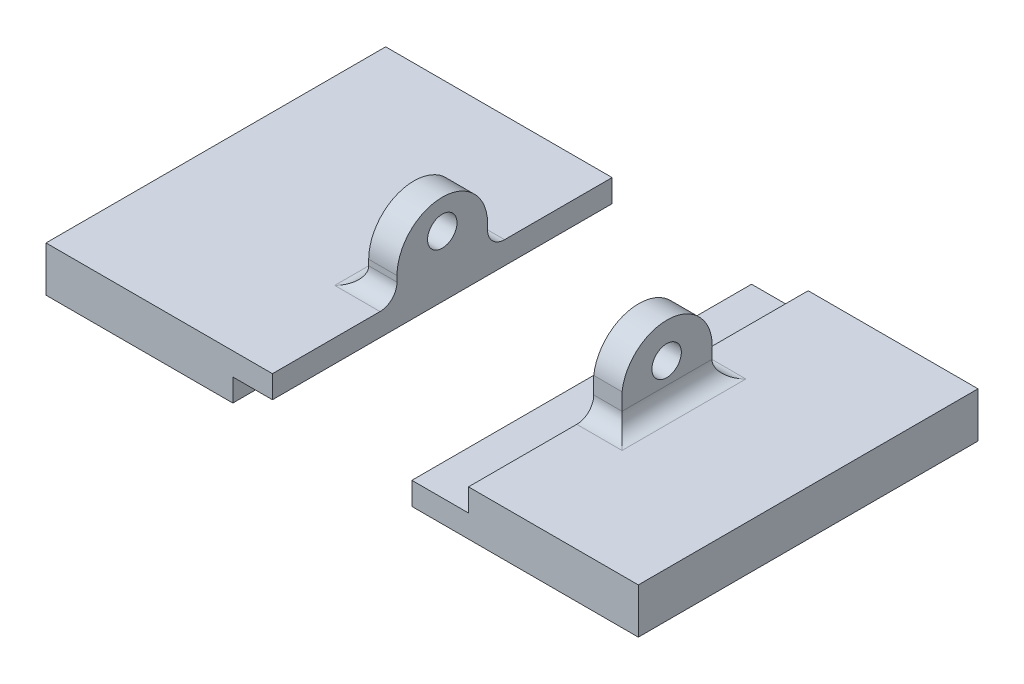
ISO-10303-21;
HEADER;
FILE_DESCRIPTION(('STEP AP214'),'2;1');
FILE_NAME('part.step','',(''),(''),'','','');
FILE_SCHEMA(('AUTOMOTIVE_DESIGN { 1 0 10303 214 1 1 1 1 }'));
ENDSEC;
DATA;
#1=APPLICATION_CONTEXT('core data for automotive mechanical design processes');
#2=APPLICATION_PROTOCOL_DEFINITION('international standard','automotive_design',2000,#1);
#3=PRODUCT_CONTEXT('',#1,'mechanical');
#4=PRODUCT('Part','Part','',(#3));
#5=PRODUCT_RELATED_PRODUCT_CATEGORY('part','',(#4));
#6=PRODUCT_DEFINITION_FORMATION('','',#4);
#7=PRODUCT_DEFINITION_CONTEXT('part definition',#1,'design');
#8=PRODUCT_DEFINITION('design','',#6,#7);
#9=PRODUCT_DEFINITION_SHAPE('','',#8);
#10=(LENGTH_UNIT() NAMED_UNIT(*) SI_UNIT(.MILLI.,.METRE.));
#11=(NAMED_UNIT(*) PLANE_ANGLE_UNIT() SI_UNIT($,.RADIAN.));
#12=(NAMED_UNIT(*) SI_UNIT($,.STERADIAN.) SOLID_ANGLE_UNIT());
#13=UNCERTAINTY_MEASURE_WITH_UNIT(LENGTH_MEASURE(1.E-05),#10,'distance_accuracy_value','');
#14=(GEOMETRIC_REPRESENTATION_CONTEXT(3) GLOBAL_UNCERTAINTY_ASSIGNED_CONTEXT((#13)) GLOBAL_UNIT_ASSIGNED_CONTEXT((#10,
#11,#12)) REPRESENTATION_CONTEXT('',''));
#15=CARTESIAN_POINT('',(0.,0.,0.));
#16=DIRECTION('',(0.,0.,1.));
#17=DIRECTION('',(1.,0.,0.));
#18=AXIS2_PLACEMENT_3D('',#15,#16,#17);
#19=CARTESIAN_POINT('',(0.,4.,0.));
#20=DIRECTION('',(0.,1.,0.));
#21=DIRECTION('',(0.,0.,1.));
#22=AXIS2_PLACEMENT_3D('',#19,#20,#21);
#23=PLANE('',#22);
#24=DIRECTION('',(0.,0.,1.));
#25=VECTOR('',#24,1.);
#26=CARTESIAN_POINT('',(21.3135912967573,4.,0.));
#27=LINE('',#26,#25);
#28=CARTESIAN_POINT('',(21.3135912967573,4.,-2.61678832116789));
#29=VERTEX_POINT('',#28);
#30=CARTESIAN_POINT('',(21.3135912967573,4.,8.32143469254145));
#31=VERTEX_POINT('',#30);
#32=EDGE_CURVE('E219',#29,#31,#27,.T.);
#33=ORIENTED_EDGE('',*,*,#32,.T.);
#34=DIRECTION('',(-1.,0.,0.));
#35=VECTOR('',#34,1.);
#36=CARTESIAN_POINT('',(17.3135912967573,4.,8.32143469254145));
#37=LINE('',#36,#35);
#38=CARTESIAN_POINT('',(17.3135912967573,4.,8.32143469254145));
#39=VERTEX_POINT('',#38);
#40=EDGE_CURVE('E221',#31,#39,#37,.T.);
#41=ORIENTED_EDGE('',*,*,#40,.T.);
#42=DIRECTION('',(0.,0.,-1.));
#43=VECTOR('',#42,1.);
#44=CARTESIAN_POINT('',(17.3135912967573,4.,-12.1167883211679));
#45=LINE('',#44,#43);
#46=CARTESIAN_POINT('',(17.3135912967573,4.,17.8832116788321));
#47=VERTEX_POINT('',#46);
#48=EDGE_CURVE('E181',#47,#39,#45,.T.);
#49=ORIENTED_EDGE('',*,*,#48,.F.);
#50=DIRECTION('',(1.,0.,0.));
#51=VECTOR('',#50,1.);
#52=CARTESIAN_POINT('',(12.3135912967573,4.,17.8832116788321));
#53=LINE('',#52,#51);
#54=CARTESIAN_POINT('',(32.3135912967573,4.,17.8832116788321));
#55=VERTEX_POINT('',#54);
#56=EDGE_CURVE('E191',#47,#55,#53,.T.);
#57=ORIENTED_EDGE('',*,*,#56,.T.);
#58=DIRECTION('',(0.,0.,-1.));
#59=VECTOR('',#58,1.);
#60=CARTESIAN_POINT('',(32.3135912967573,4.,-12.1167883211679));
#61=LINE('',#60,#59);
#62=CARTESIAN_POINT('',(32.3135912967573,4.,-12.1167883211679));
#63=VERTEX_POINT('',#62);
#64=EDGE_CURVE('E193',#55,#63,#61,.T.);
#65=ORIENTED_EDGE('',*,*,#64,.T.);
#66=DIRECTION('',(-1.,0.,0.));
#67=VECTOR('',#66,1.);
#68=CARTESIAN_POINT('',(12.3135912967573,4.,-12.1167883211679));
#69=LINE('',#68,#67);
#70=CARTESIAN_POINT('',(17.3135912967573,4.,-12.1167883211679));
#71=VERTEX_POINT('',#70);
#72=EDGE_CURVE('E196',#63,#71,#69,.T.);
#73=ORIENTED_EDGE('',*,*,#72,.T.);
#74=CARTESIAN_POINT('',(17.3135912967573,4.,-2.61678832116789));
#75=VERTEX_POINT('',#74);
#76=EDGE_CURVE('E180',#75,#71,#45,.T.);
#77=ORIENTED_EDGE('',*,*,#76,.F.);
#78=DIRECTION('',(-1.,0.,0.));
#79=VECTOR('',#78,1.);
#80=CARTESIAN_POINT('',(19.8135912967573,4.,-2.61678832116789));
#81=LINE('',#80,#79);
#82=EDGE_CURVE('E217',#75,#29,#81,.F.);
#83=ORIENTED_EDGE('',*,*,#82,.T.);
#84=EDGE_LOOP('',(#33,#41,#49,#57,#65,#73,#77,#83));
#85=FACE_BOUND('',#84,.T.);
#86=ADVANCED_FACE('F49',(#85),#23,.T.);
#87=CARTESIAN_POINT('',(12.3135912967573,4.,-12.1167883211679));
#88=DIRECTION('',(1.,0.,0.));
#89=DIRECTION('',(0.,0.,-1.));
#90=AXIS2_PLACEMENT_3D('',#87,#88,#89);
#91=PLANE('',#90);
#92=DIRECTION('',(0.,-1.,0.));
#93=VECTOR('',#92,1.);
#94=CARTESIAN_POINT('',(12.3135912967573,4.,17.8832116788321));
#95=LINE('',#94,#93);
#96=CARTESIAN_POINT('',(12.3135912967573,2.,17.8832116788321));
#97=VERTEX_POINT('',#96);
#98=CARTESIAN_POINT('',(12.3135912967573,0.,17.8832116788321));
#99=VERTEX_POINT('',#98);
#100=EDGE_CURVE('E215',#97,#99,#95,.T.);
#101=ORIENTED_EDGE('',*,*,#100,.F.);
#102=DIRECTION('',(0.,0.,1.));
#103=VECTOR('',#102,1.);
#104=CARTESIAN_POINT('',(12.3135912967573,2.,-12.1167883211679));
#105=LINE('',#104,#103);
#106=CARTESIAN_POINT('',(12.3135912967573,2.,-12.1167883211679));
#107=VERTEX_POINT('',#106);
#108=EDGE_CURVE('E170',#107,#97,#105,.T.);
#109=ORIENTED_EDGE('',*,*,#108,.F.);
#110=DIRECTION('',(0.,-1.,0.));
#111=VECTOR('',#110,1.);
#112=CARTESIAN_POINT('',(12.3135912967573,4.,-12.1167883211679));
#113=LINE('',#112,#111);
#114=CARTESIAN_POINT('',(12.3135912967573,0.,-12.1167883211679));
#115=VERTEX_POINT('',#114);
#116=EDGE_CURVE('E199',#107,#115,#113,.T.);
#117=ORIENTED_EDGE('',*,*,#116,.T.);
#118=DIRECTION('',(0.,0.,1.));
#119=VECTOR('',#118,1.);
#120=CARTESIAN_POINT('',(12.3135912967573,0.,-12.1167883211679));
#121=LINE('',#120,#119);
#122=EDGE_CURVE('E189',#115,#99,#121,.T.);
#123=ORIENTED_EDGE('',*,*,#122,.T.);
#124=EDGE_LOOP('',(#101,#109,#117,#123));
#125=FACE_BOUND('',#124,.T.);
#126=ADVANCED_FACE('F278',(#125),#91,.F.);
#127=CARTESIAN_POINT('',(12.3135912967573,4.,17.8832116788321));
#128=DIRECTION('',(0.,0.,-1.));
#129=DIRECTION('',(-1.,0.,0.));
#130=AXIS2_PLACEMENT_3D('',#127,#128,#129);
#131=PLANE('',#130);
#132=DIRECTION('',(0.,1.,0.));
#133=VECTOR('',#132,1.);
#134=CARTESIAN_POINT('',(17.3135912967573,4.,17.8832116788321));
#135=LINE('',#134,#133);
#136=CARTESIAN_POINT('',(17.3135912967573,2.,17.8832116788321));
#137=VERTEX_POINT('',#136);
#138=EDGE_CURVE('E178',#137,#47,#135,.T.);
#139=ORIENTED_EDGE('',*,*,#138,.F.);
#140=DIRECTION('',(-1.,0.,0.));
#141=VECTOR('',#140,1.);
#142=CARTESIAN_POINT('',(17.3135912967573,2.,17.8832116788321));
#143=LINE('',#142,#141);
#144=EDGE_CURVE('E186',#137,#97,#143,.T.);
#145=ORIENTED_EDGE('',*,*,#144,.T.);
#146=ORIENTED_EDGE('',*,*,#100,.T.);
#147=DIRECTION('',(1.,0.,0.));
#148=VECTOR('',#147,1.);
#149=CARTESIAN_POINT('',(12.3135912967573,0.,17.8832116788321));
#150=LINE('',#149,#148);
#151=CARTESIAN_POINT('',(32.3135912967573,0.,17.8832116788321));
#152=VERTEX_POINT('',#151);
#153=EDGE_CURVE('E202',#99,#152,#150,.T.);
#154=ORIENTED_EDGE('',*,*,#153,.T.);
#155=DIRECTION('',(0.,-1.,0.));
#156=VECTOR('',#155,1.);
#157=CARTESIAN_POINT('',(32.3135912967573,4.,17.8832116788321));
#158=LINE('',#157,#156);
#159=EDGE_CURVE('E212',#55,#152,#158,.T.);
#160=ORIENTED_EDGE('',*,*,#159,.F.);
#161=ORIENTED_EDGE('',*,*,#56,.F.);
#162=EDGE_LOOP('',(#139,#145,#146,#154,#160,#161));
#163=FACE_BOUND('',#162,.T.);
#164=ADVANCED_FACE('F266',(#163),#131,.F.);
#165=CARTESIAN_POINT('',(32.3135912967573,4.,-12.1167883211679));
#166=DIRECTION('',(-1.,0.,0.));
#167=DIRECTION('',(0.,0.,1.));
#168=AXIS2_PLACEMENT_3D('',#165,#166,#167);
#169=PLANE('',#168);
#170=DIRECTION('',(0.,0.,-1.));
#171=VECTOR('',#170,1.);
#172=CARTESIAN_POINT('',(32.3135912967573,0.,-12.1167883211679));
#173=LINE('',#172,#171);
#174=CARTESIAN_POINT('',(32.3135912967573,0.,-12.1167883211679));
#175=VERTEX_POINT('',#174);
#176=EDGE_CURVE('E204',#152,#175,#173,.T.);
#177=ORIENTED_EDGE('',*,*,#176,.T.);
#178=DIRECTION('',(0.,-1.,0.));
#179=VECTOR('',#178,1.);
#180=CARTESIAN_POINT('',(32.3135912967573,4.,-12.1167883211679));
#181=LINE('',#180,#179);
#182=EDGE_CURVE('E209',#63,#175,#181,.T.);
#183=ORIENTED_EDGE('',*,*,#182,.F.);
#184=ORIENTED_EDGE('',*,*,#64,.F.);
#185=ORIENTED_EDGE('',*,*,#159,.T.);
#186=EDGE_LOOP('',(#177,#183,#184,#185));
#187=FACE_BOUND('',#186,.T.);
#188=ADVANCED_FACE('F294',(#187),#169,.F.);
#189=CARTESIAN_POINT('',(12.3135912967573,4.,-12.1167883211679));
#190=DIRECTION('',(0.,0.,1.));
#191=DIRECTION('',(1.,0.,0.));
#192=AXIS2_PLACEMENT_3D('',#189,#190,#191);
#193=PLANE('',#192);
#194=ORIENTED_EDGE('',*,*,#116,.F.);
#195=DIRECTION('',(-1.,0.,0.));
#196=VECTOR('',#195,1.);
#197=CARTESIAN_POINT('',(17.3135912967573,2.,-12.1167883211679));
#198=LINE('',#197,#196);
#199=CARTESIAN_POINT('',(17.3135912967573,2.,-12.1167883211679));
#200=VERTEX_POINT('',#199);
#201=EDGE_CURVE('E184',#200,#107,#198,.T.);
#202=ORIENTED_EDGE('',*,*,#201,.F.);
#203=DIRECTION('',(0.,-1.,0.));
#204=VECTOR('',#203,1.);
#205=CARTESIAN_POINT('',(17.3135912967573,4.,-12.1167883211679));
#206=LINE('',#205,#204);
#207=EDGE_CURVE('E172',#71,#200,#206,.T.);
#208=ORIENTED_EDGE('',*,*,#207,.F.);
#209=ORIENTED_EDGE('',*,*,#72,.F.);
#210=ORIENTED_EDGE('',*,*,#182,.T.);
#211=DIRECTION('',(-1.,0.,0.));
#212=VECTOR('',#211,1.);
#213=CARTESIAN_POINT('',(12.3135912967573,0.,-12.1167883211679));
#214=LINE('',#213,#212);
#215=EDGE_CURVE('E194',#175,#115,#214,.T.);
#216=ORIENTED_EDGE('',*,*,#215,.T.);
#217=EDGE_LOOP('',(#194,#202,#208,#209,#210,#216));
#218=FACE_BOUND('',#217,.T.);
#219=ADVANCED_FACE('F258',(#218),#193,.F.);
#220=CARTESIAN_POINT('',(0.,0.,0.));
#221=DIRECTION('',(0.,1.,0.));
#222=DIRECTION('',(0.,0.,1.));
#223=AXIS2_PLACEMENT_3D('',#220,#221,#222);
#224=PLANE('',#223);
#225=ORIENTED_EDGE('',*,*,#122,.F.);
#226=ORIENTED_EDGE('',*,*,#215,.F.);
#227=ORIENTED_EDGE('',*,*,#176,.F.);
#228=ORIENTED_EDGE('',*,*,#153,.F.);
#229=EDGE_LOOP('',(#225,#226,#227,#228));
#230=FACE_BOUND('',#229,.T.);
#231=ADVANCED_FACE('F288',(#230),#224,.F.);
#232=CARTESIAN_POINT('',(17.3135912967573,2.,-12.1167883211679));
#233=DIRECTION('',(0.,-1.,0.));
#234=DIRECTION('',(0.,0.,-1.));
#235=AXIS2_PLACEMENT_3D('',#232,#233,#234);
#236=PLANE('',#235);
#237=ORIENTED_EDGE('',*,*,#108,.T.);
#238=ORIENTED_EDGE('',*,*,#144,.F.);
#239=DIRECTION('',(0.,0.,1.));
#240=VECTOR('',#239,1.);
#241=CARTESIAN_POINT('',(17.3135912967573,2.,-12.1167883211679));
#242=LINE('',#241,#240);
#243=EDGE_CURVE('E175',#200,#137,#242,.T.);
#244=ORIENTED_EDGE('',*,*,#243,.F.);
#245=ORIENTED_EDGE('',*,*,#201,.T.);
#246=EDGE_LOOP('',(#237,#238,#244,#245));
#247=FACE_BOUND('',#246,.T.);
#248=ADVANCED_FACE('F286',(#247),#236,.F.);
#249=CARTESIAN_POINT('',(17.3135912967573,0.,0.));
#250=DIRECTION('',(-1.,0.,0.));
#251=DIRECTION('',(0.,0.,1.));
#252=AXIS2_PLACEMENT_3D('',#249,#250,#251);
#253=PLANE('',#252);
#254=ORIENTED_EDGE('',*,*,#207,.T.);
#255=ORIENTED_EDGE('',*,*,#243,.T.);
#256=ORIENTED_EDGE('',*,*,#138,.T.);
#257=ORIENTED_EDGE('',*,*,#48,.T.);
#258=CARTESIAN_POINT('',(17.3135912967573,5.5,8.32143469254145));
#259=DIRECTION('',(-1.,0.,0.));
#260=DIRECTION('',(0.,0.,1.));
#261=AXIS2_PLACEMENT_3D('',#258,#259,#260);
#262=CIRCLE('',#261,1.5);
#263=CARTESIAN_POINT('',(17.3135912967573,5.5,6.82143469254145));
#264=VERTEX_POINT('',#263);
#265=EDGE_CURVE('E58',#39,#264,#262,.F.);
#266=ORIENTED_EDGE('',*,*,#265,.T.);
#267=DIRECTION('',(0.,1.,0.));
#268=VECTOR('',#267,1.);
#269=CARTESIAN_POINT('',(17.3135912967573,4.,6.82143469254145));
#270=LINE('',#269,#268);
#271=CARTESIAN_POINT('',(17.3135912967573,6.99227787671367,6.82143469254145));
#272=VERTEX_POINT('',#271);
#273=EDGE_CURVE('E166',#264,#272,#270,.T.);
#274=ORIENTED_EDGE('',*,*,#273,.T.);
#275=CARTESIAN_POINT('',(17.3135912967573,6.49613893835684,2.85232318568678));
#276=DIRECTION('',(-1.,0.,0.));
#277=DIRECTION('',(0.,0.,1.));
#278=AXIS2_PLACEMENT_3D('',#275,#276,#277);
#279=CIRCLE('',#278,4.);
#280=CARTESIAN_POINT('',(17.3135912967573,6.,-1.11678832116789));
#281=VERTEX_POINT('',#280);
#282=EDGE_CURVE('E157',#272,#281,#279,.T.);
#283=ORIENTED_EDGE('',*,*,#282,.T.);
#284=DIRECTION('',(0.,-1.,0.));
#285=VECTOR('',#284,1.);
#286=CARTESIAN_POINT('',(17.3135912967573,4.,-1.11678832116789));
#287=LINE('',#286,#285);
#288=CARTESIAN_POINT('',(17.3135912967573,5.5,-1.11678832116789));
#289=VERTEX_POINT('',#288);
#290=EDGE_CURVE('E164',#281,#289,#287,.T.);
#291=ORIENTED_EDGE('',*,*,#290,.T.);
#292=CARTESIAN_POINT('',(17.3135912967573,5.5,-2.61678832116789));
#293=DIRECTION('',(-1.,0.,0.));
#294=DIRECTION('',(0.,0.,1.));
#295=AXIS2_PLACEMENT_3D('',#292,#293,#294);
#296=CIRCLE('',#295,1.5);
#297=EDGE_CURVE('E12',#289,#75,#296,.F.);
#298=ORIENTED_EDGE('',*,*,#297,.T.);
#299=ORIENTED_EDGE('',*,*,#76,.T.);
#300=EDGE_LOOP('',(#254,#255,#256,#257,#266,#274,#283,#291,#298,#299));
#301=FACE_BOUND('',#300,.T.);
#302=CARTESIAN_POINT('',(17.3135912967573,7.4,2.88321167883211));
#303=DIRECTION('',(-1.,0.,0.));
#304=DIRECTION('',(0.,0.,1.));
#305=AXIS2_PLACEMENT_3D('',#302,#303,#304);
#306=CIRCLE('',#305,1.3);
#307=CARTESIAN_POINT('',(17.3135912967573,7.4,4.18321167883211));
#308=VERTEX_POINT('',#307);
#309=EDGE_CURVE('E233',#308,#308,#306,.T.);
#310=ORIENTED_EDGE('',*,*,#309,.F.);
#311=EDGE_LOOP('',(#310));
#312=FACE_BOUND('',#311,.T.);
#313=ADVANCED_FACE('F249',(#301,#312),#253,.T.);
#314=CARTESIAN_POINT('',(19.8135912967573,4.,-1.11678832116789));
#315=DIRECTION('',(0.,0.,-1.));
#316=DIRECTION('',(-1.,0.,0.));
#317=AXIS2_PLACEMENT_3D('',#314,#315,#316);
#318=PLANE('',#317);
#319=DIRECTION('',(0.,-1.,0.));
#320=VECTOR('',#319,1.);
#321=CARTESIAN_POINT('',(19.8135912967573,4.,-1.11678832116789));
#322=LINE('',#321,#320);
#323=CARTESIAN_POINT('',(19.8135912967573,6.,-1.11678832116789));
#324=VERTEX_POINT('',#323);
#325=CARTESIAN_POINT('',(19.8135912967573,5.5,-1.11678832116789));
#326=VERTEX_POINT('',#325);
#327=EDGE_CURVE('E151',#324,#326,#322,.T.);
#328=ORIENTED_EDGE('',*,*,#327,.T.);
#329=DIRECTION('',(-1.,0.,0.));
#330=VECTOR('',#329,1.);
#331=CARTESIAN_POINT('',(17.3135912967573,5.5,-1.11678832116789));
#332=LINE('',#331,#330);
#333=EDGE_CURVE('E66',#326,#289,#332,.T.);
#334=ORIENTED_EDGE('',*,*,#333,.T.);
#335=ORIENTED_EDGE('',*,*,#290,.F.);
#336=DIRECTION('',(-1.,0.,0.));
#337=VECTOR('',#336,1.);
#338=CARTESIAN_POINT('',(19.8135912967573,6.,-1.11678832116789));
#339=LINE('',#338,#337);
#340=EDGE_CURVE('E158',#324,#281,#339,.T.);
#341=ORIENTED_EDGE('',*,*,#340,.F.);
#342=EDGE_LOOP('',(#328,#334,#335,#341));
#343=FACE_BOUND('',#342,.T.);
#344=ADVANCED_FACE('F243',(#343),#318,.T.);
#345=CARTESIAN_POINT('',(19.8135912967573,6.49613893835684,2.85232318568678));
#346=DIRECTION('',(-1.,0.,0.));
#347=DIRECTION('',(0.,0.,1.));
#348=AXIS2_PLACEMENT_3D('',#345,#346,#347);
#349=CYLINDRICAL_SURFACE('',#348,4.);
#350=ORIENTED_EDGE('',*,*,#282,.F.);
#351=DIRECTION('',(-1.,0.,0.));
#352=VECTOR('',#351,1.);
#353=CARTESIAN_POINT('',(19.8135912967573,6.99227787671367,6.82143469254145));
#354=LINE('',#353,#352);
#355=CARTESIAN_POINT('',(19.8135912967573,6.99227787671367,6.82143469254145));
#356=VERTEX_POINT('',#355);
#357=EDGE_CURVE('E145',#356,#272,#354,.T.);
#358=ORIENTED_EDGE('',*,*,#357,.F.);
#359=CARTESIAN_POINT('',(19.8135912967573,6.49613893835684,2.85232318568678));
#360=DIRECTION('',(-1.,0.,0.));
#361=DIRECTION('',(0.,0.,1.));
#362=AXIS2_PLACEMENT_3D('',#359,#360,#361);
#363=CIRCLE('',#362,4.);
#364=EDGE_CURVE('E150',#356,#324,#363,.T.);
#365=ORIENTED_EDGE('',*,*,#364,.T.);
#366=ORIENTED_EDGE('',*,*,#340,.T.);
#367=EDGE_LOOP('',(#350,#358,#365,#366));
#368=FACE_BOUND('',#367,.T.);
#369=ADVANCED_FACE('F155',(#368),#349,.T.);
#370=CARTESIAN_POINT('',(19.8135912967573,4.,6.82143469254145));
#371=DIRECTION('',(0.,0.,1.));
#372=DIRECTION('',(0.,-1.,0.));
#373=AXIS2_PLACEMENT_3D('',#370,#371,#372);
#374=PLANE('',#373);
#375=ORIENTED_EDGE('',*,*,#273,.F.);
#376=DIRECTION('',(-1.,0.,0.));
#377=VECTOR('',#376,1.);
#378=CARTESIAN_POINT('',(19.8135912967573,5.5,6.82143469254145));
#379=LINE('',#378,#377);
#380=CARTESIAN_POINT('',(19.8135912967573,5.5,6.82143469254145));
#381=VERTEX_POINT('',#380);
#382=EDGE_CURVE('E148',#264,#381,#379,.F.);
#383=ORIENTED_EDGE('',*,*,#382,.T.);
#384=DIRECTION('',(0.,1.,0.));
#385=VECTOR('',#384,1.);
#386=CARTESIAN_POINT('',(19.8135912967573,4.,6.82143469254145));
#387=LINE('',#386,#385);
#388=EDGE_CURVE('E141',#381,#356,#387,.T.);
#389=ORIENTED_EDGE('',*,*,#388,.T.);
#390=ORIENTED_EDGE('',*,*,#357,.T.);
#391=EDGE_LOOP('',(#375,#383,#389,#390));
#392=FACE_BOUND('',#391,.T.);
#393=ADVANCED_FACE('F144',(#392),#374,.T.);
#394=CARTESIAN_POINT('',(19.8135912967573,6.49613893835684,2.85232318568678));
#395=DIRECTION('',(-1.,0.,0.));
#396=DIRECTION('',(0.,0.,1.));
#397=AXIS2_PLACEMENT_3D('',#394,#395,#396);
#398=PLANE('',#397);
#399=CARTESIAN_POINT('',(19.8135912967573,7.4,2.88321167883211));
#400=DIRECTION('',(-1.,0.,0.));
#401=DIRECTION('',(0.,0.,1.));
#402=AXIS2_PLACEMENT_3D('',#399,#400,#401);
#403=CIRCLE('',#402,1.3);
#404=CARTESIAN_POINT('',(19.8135912967573,7.4,4.18321167883211));
#405=VERTEX_POINT('',#404);
#406=EDGE_CURVE('E167',#405,#405,#403,.T.);
#407=ORIENTED_EDGE('',*,*,#406,.T.);
#408=EDGE_LOOP('',(#407));
#409=FACE_BOUND('',#408,.T.);
#410=ORIENTED_EDGE('',*,*,#388,.F.);
#411=DIRECTION('',(0.,0.,1.));
#412=VECTOR('',#411,1.);
#413=CARTESIAN_POINT('',(19.8135912967573,5.5,2.85232318568678));
#414=LINE('',#413,#412);
#415=EDGE_CURVE('E74',#381,#326,#414,.F.);
#416=ORIENTED_EDGE('',*,*,#415,.T.);
#417=ORIENTED_EDGE('',*,*,#327,.F.);
#418=ORIENTED_EDGE('',*,*,#364,.F.);
#419=EDGE_LOOP('',(#410,#416,#417,#418));
#420=FACE_BOUND('',#419,.T.);
#421=ADVANCED_FACE('F160',(#409,#420),#398,.F.);
#422=CARTESIAN_POINT('',(19.8135912967573,7.4,2.88321167883211));
#423=DIRECTION('',(-1.,0.,0.));
#424=DIRECTION('',(0.,0.,1.));
#425=AXIS2_PLACEMENT_3D('',#422,#423,#424);
#426=CYLINDRICAL_SURFACE('',#425,1.3);
#427=ORIENTED_EDGE('',*,*,#406,.F.);
#428=EDGE_LOOP('',(#427));
#429=FACE_BOUND('',#428,.T.);
#430=ORIENTED_EDGE('',*,*,#309,.T.);
#431=EDGE_LOOP('',(#430));
#432=FACE_BOUND('',#431,.T.);
#433=ADVANCED_FACE('F350',(#429,#432),#426,.F.);
#434=CARTESIAN_POINT('',(19.8135912967573,5.5,-2.61678832116789));
#435=DIRECTION('',(1.,0.,0.));
#436=DIRECTION('',(0.,0.,-1.));
#437=AXIS2_PLACEMENT_3D('',#434,#435,#436);
#438=CYLINDRICAL_SURFACE('',#437,1.5);
#439=ORIENTED_EDGE('',*,*,#297,.F.);
#440=ORIENTED_EDGE('',*,*,#333,.F.);
#441=CARTESIAN_POINT('',(21.3135912967573,5.5,-2.61678832116789));
#442=DIRECTION('',(0.707106781186547,0.,0.707106781186547));
#443=DIRECTION('',(0.707106781186547,0.,-0.707106781186547));
#444=AXIS2_PLACEMENT_3D('',#441,#442,#443);
#445=ELLIPSE('',#444,2.12132034355964,1.5);
#446=EDGE_CURVE('E53',#29,#326,#445,.F.);
#447=ORIENTED_EDGE('',*,*,#446,.F.);
#448=ORIENTED_EDGE('',*,*,#82,.F.);
#449=EDGE_LOOP('',(#439,#440,#447,#448));
#450=FACE_BOUND('',#449,.T.);
#451=ADVANCED_FACE('F51',(#450),#438,.F.);
#452=CARTESIAN_POINT('',(21.3135912967573,5.5,0.));
#453=DIRECTION('',(0.,0.,1.));
#454=DIRECTION('',(1.,0.,0.));
#455=AXIS2_PLACEMENT_3D('',#452,#453,#454);
#456=CYLINDRICAL_SURFACE('',#455,1.5);
#457=ORIENTED_EDGE('',*,*,#446,.T.);
#458=ORIENTED_EDGE('',*,*,#415,.F.);
#459=CARTESIAN_POINT('',(21.3135912967573,5.5,8.32143469254145));
#460=DIRECTION('',(-0.707106781186547,0.,0.707106781186547));
#461=DIRECTION('',(0.707106781186547,0.,0.707106781186547));
#462=AXIS2_PLACEMENT_3D('',#459,#460,#461);
#463=ELLIPSE('',#462,2.12132034355964,1.5);
#464=EDGE_CURVE('E227',#31,#381,#463,.F.);
#465=ORIENTED_EDGE('',*,*,#464,.F.);
#466=ORIENTED_EDGE('',*,*,#32,.F.);
#467=EDGE_LOOP('',(#457,#458,#465,#466));
#468=FACE_BOUND('',#467,.T.);
#469=ADVANCED_FACE('F271',(#468),#456,.F.);
#470=CARTESIAN_POINT('',(0.,5.5,8.32143469254145));
#471=DIRECTION('',(1.,0.,0.));
#472=DIRECTION('',(0.,0.,-1.));
#473=AXIS2_PLACEMENT_3D('',#470,#471,#472);
#474=CYLINDRICAL_SURFACE('',#473,1.5);
#475=ORIENTED_EDGE('',*,*,#464,.T.);
#476=ORIENTED_EDGE('',*,*,#382,.F.);
#477=ORIENTED_EDGE('',*,*,#265,.F.);
#478=ORIENTED_EDGE('',*,*,#40,.F.);
#479=EDGE_LOOP('',(#475,#476,#477,#478));
#480=FACE_BOUND('',#479,.T.);
#481=ADVANCED_FACE('F269',(#480),#474,.F.);
#482=CLOSED_SHELL('',(#86,#126,#164,#188,#219,#231,#248,#313,#344,#369,#393,#421,#433,#451,#469,#481));
#483=MANIFOLD_SOLID_BREP('B2',#482);
#484=CARTESIAN_POINT('',(0.,4.,0.));
#485=DIRECTION('',(0.,-1.,0.));
#486=DIRECTION('',(0.,0.,-1.));
#487=AXIS2_PLACEMENT_3D('',#484,#485,#486);
#488=PLANE('',#487);
#489=DIRECTION('',(0.,0.,-1.));
#490=VECTOR('',#489,1.);
#491=CARTESIAN_POINT('',(-4.,4.,-1.11678832116789));
#492=LINE('',#491,#490);
#493=CARTESIAN_POINT('',(-4.,4.,8.38321167883211));
#494=VERTEX_POINT('',#493);
#495=CARTESIAN_POINT('',(-4.,4.,-2.61678832116789));
#496=VERTEX_POINT('',#495);
#497=EDGE_CURVE('E615',#494,#496,#492,.T.);
#498=ORIENTED_EDGE('',*,*,#497,.T.);
#499=DIRECTION('',(1.,0.,0.));
#500=VECTOR('',#499,1.);
#501=CARTESIAN_POINT('',(0.,4.,-2.61678832116789));
#502=LINE('',#501,#500);
#503=CARTESIAN_POINT('',(0.,4.,-2.61678832116789));
#504=VERTEX_POINT('',#503);
#505=EDGE_CURVE('E618',#496,#504,#502,.T.);
#506=ORIENTED_EDGE('',*,*,#505,.T.);
#507=DIRECTION('',(0.,0.,-1.));
#508=VECTOR('',#507,1.);
#509=CARTESIAN_POINT('',(0.,4.,-12.1167883211679));
#510=LINE('',#509,#508);
#511=CARTESIAN_POINT('',(0.,4.,-12.1167883211679));
#512=VERTEX_POINT('',#511);
#513=EDGE_CURVE('E578',#504,#512,#510,.T.);
#514=ORIENTED_EDGE('',*,*,#513,.T.);
#515=DIRECTION('',(-1.,0.,0.));
#516=VECTOR('',#515,1.);
#517=CARTESIAN_POINT('',(0.,4.,-12.1167883211679));
#518=LINE('',#517,#516);
#519=CARTESIAN_POINT('',(-20.,4.,-12.1167883211679));
#520=VERTEX_POINT('',#519);
#521=EDGE_CURVE('E577',#512,#520,#518,.T.);
#522=ORIENTED_EDGE('',*,*,#521,.T.);
#523=DIRECTION('',(0.,0.,1.));
#524=VECTOR('',#523,1.);
#525=CARTESIAN_POINT('',(-20.,4.,-12.1167883211679));
#526=LINE('',#525,#524);
#527=CARTESIAN_POINT('',(-20.,4.,17.8832116788321));
#528=VERTEX_POINT('',#527);
#529=EDGE_CURVE('E581',#520,#528,#526,.T.);
#530=ORIENTED_EDGE('',*,*,#529,.T.);
#531=DIRECTION('',(1.,0.,0.));
#532=VECTOR('',#531,1.);
#533=CARTESIAN_POINT('',(0.,4.,17.8832116788321));
#534=LINE('',#533,#532);
#535=CARTESIAN_POINT('',(0.,4.,17.8832116788321));
#536=VERTEX_POINT('',#535);
#537=EDGE_CURVE('E584',#528,#536,#534,.T.);
#538=ORIENTED_EDGE('',*,*,#537,.T.);
#539=CARTESIAN_POINT('',(0.,4.,8.3832116788321));
#540=VERTEX_POINT('',#539);
#541=EDGE_CURVE('E573',#536,#540,#510,.T.);
#542=ORIENTED_EDGE('',*,*,#541,.T.);
#543=DIRECTION('',(1.,0.,0.));
#544=VECTOR('',#543,1.);
#545=CARTESIAN_POINT('',(0.,4.,8.38321167883211));
#546=LINE('',#545,#544);
#547=EDGE_CURVE('E612',#540,#494,#546,.F.);
#548=ORIENTED_EDGE('',*,*,#547,.T.);
#549=EDGE_LOOP('',(#498,#506,#514,#522,#530,#538,#542,#548));
#550=FACE_BOUND('',#549,.T.);
#551=ADVANCED_FACE('F418',(#550),#488,.F.);
#552=CARTESIAN_POINT('',(0.,0.,0.));
#553=DIRECTION('',(0.,-1.,0.));
#554=DIRECTION('',(0.,0.,-1.));
#555=AXIS2_PLACEMENT_3D('',#552,#553,#554);
#556=PLANE('',#555);
#557=DIRECTION('',(-1.,0.,0.));
#558=VECTOR('',#557,1.);
#559=CARTESIAN_POINT('',(0.,0.,-12.1167883211679));
#560=LINE('',#559,#558);
#561=CARTESIAN_POINT('',(-3.5,0.,-12.1167883211679));
#562=VERTEX_POINT('',#561);
#563=CARTESIAN_POINT('',(-20.,0.,-12.1167883211679));
#564=VERTEX_POINT('',#563);
#565=EDGE_CURVE('E570',#562,#564,#560,.T.);
#566=ORIENTED_EDGE('',*,*,#565,.F.);
#567=DIRECTION('',(0.,0.,-1.));
#568=VECTOR('',#567,1.);
#569=CARTESIAN_POINT('',(-3.5,0.,-12.1167883211679));
#570=LINE('',#569,#568);
#571=CARTESIAN_POINT('',(-3.5,0.,17.8832116788321));
#572=VERTEX_POINT('',#571);
#573=EDGE_CURVE('E560',#572,#562,#570,.T.);
#574=ORIENTED_EDGE('',*,*,#573,.F.);
#575=DIRECTION('',(1.,0.,0.));
#576=VECTOR('',#575,1.);
#577=CARTESIAN_POINT('',(0.,0.,17.8832116788321));
#578=LINE('',#577,#576);
#579=CARTESIAN_POINT('',(-20.,0.,17.8832116788321));
#580=VERTEX_POINT('',#579);
#581=EDGE_CURVE('E593',#580,#572,#578,.T.);
#582=ORIENTED_EDGE('',*,*,#581,.F.);
#583=DIRECTION('',(0.,0.,1.));
#584=VECTOR('',#583,1.);
#585=CARTESIAN_POINT('',(-20.,0.,-12.1167883211679));
#586=LINE('',#585,#584);
#587=EDGE_CURVE('E590',#564,#580,#586,.T.);
#588=ORIENTED_EDGE('',*,*,#587,.F.);
#589=EDGE_LOOP('',(#566,#574,#582,#588));
#590=FACE_BOUND('',#589,.T.);
#591=ADVANCED_FACE('F686',(#590),#556,.T.);
#592=CARTESIAN_POINT('',(0.,4.,-12.1167883211679));
#593=DIRECTION('',(-1.,0.,0.));
#594=DIRECTION('',(0.,0.,1.));
#595=AXIS2_PLACEMENT_3D('',#592,#593,#594);
#596=PLANE('',#595);
#597=DIRECTION('',(0.,-1.,0.));
#598=VECTOR('',#597,1.);
#599=CARTESIAN_POINT('',(0.,4.,17.8832116788321));
#600=LINE('',#599,#598);
#601=CARTESIAN_POINT('',(0.,2.,17.8832116788321));
#602=VERTEX_POINT('',#601);
#603=EDGE_CURVE('E587',#536,#602,#600,.T.);
#604=ORIENTED_EDGE('',*,*,#603,.T.);
#605=DIRECTION('',(0.,0.,1.));
#606=VECTOR('',#605,1.);
#607=CARTESIAN_POINT('',(0.,2.,-12.1167883211679));
#608=LINE('',#607,#606);
#609=CARTESIAN_POINT('',(0.,2.,-12.1167883211679));
#610=VERTEX_POINT('',#609);
#611=EDGE_CURVE('E547',#610,#602,#608,.T.);
#612=ORIENTED_EDGE('',*,*,#611,.F.);
#613=DIRECTION('',(0.,-1.,0.));
#614=VECTOR('',#613,1.);
#615=CARTESIAN_POINT('',(0.,4.,-12.1167883211679));
#616=LINE('',#615,#614);
#617=EDGE_CURVE('E608',#512,#610,#616,.T.);
#618=ORIENTED_EDGE('',*,*,#617,.F.);
#619=ORIENTED_EDGE('',*,*,#513,.F.);
#620=CARTESIAN_POINT('',(0.,5.5,-2.61678832116789));
#621=DIRECTION('',(-1.,0.,0.));
#622=DIRECTION('',(0.,0.,1.));
#623=AXIS2_PLACEMENT_3D('',#620,#621,#622);
#624=CIRCLE('',#623,1.5);
#625=CARTESIAN_POINT('',(0.,5.5,-1.11678832116789));
#626=VERTEX_POINT('',#625);
#627=EDGE_CURVE('E428',#504,#626,#624,.T.);
#628=ORIENTED_EDGE('',*,*,#627,.T.);
#629=DIRECTION('',(0.,1.,0.));
#630=VECTOR('',#629,1.);
#631=CARTESIAN_POINT('',(0.,4.,-1.11678832116789));
#632=LINE('',#631,#630);
#633=CARTESIAN_POINT('',(0.,6.,-1.11678832116789));
#634=VERTEX_POINT('',#633);
#635=EDGE_CURVE('E540',#626,#634,#632,.T.);
#636=ORIENTED_EDGE('',*,*,#635,.T.);
#637=CARTESIAN_POINT('',(0.,6.,2.88321167883211));
#638=DIRECTION('',(1.,0.,0.));
#639=DIRECTION('',(0.,0.,-1.));
#640=AXIS2_PLACEMENT_3D('',#637,#638,#639);
#641=CIRCLE('',#640,4.);
#642=CARTESIAN_POINT('',(0.,6.,6.88321167883211));
#643=VERTEX_POINT('',#642);
#644=EDGE_CURVE('E528',#634,#643,#641,.T.);
#645=ORIENTED_EDGE('',*,*,#644,.T.);
#646=DIRECTION('',(0.,-1.,0.));
#647=VECTOR('',#646,1.);
#648=CARTESIAN_POINT('',(0.,4.,6.88321167883211));
#649=LINE('',#648,#647);
#650=CARTESIAN_POINT('',(0.,5.5,6.88321167883211));
#651=VERTEX_POINT('',#650);
#652=EDGE_CURVE('E537',#643,#651,#649,.T.);
#653=ORIENTED_EDGE('',*,*,#652,.T.);
#654=CARTESIAN_POINT('',(0.,5.5,8.38321167883211));
#655=DIRECTION('',(-1.,0.,0.));
#656=DIRECTION('',(0.,0.,1.));
#657=AXIS2_PLACEMENT_3D('',#654,#655,#656);
#658=CIRCLE('',#657,1.5);
#659=EDGE_CURVE('E47',#651,#540,#658,.T.);
#660=ORIENTED_EDGE('',*,*,#659,.T.);
#661=ORIENTED_EDGE('',*,*,#541,.F.);
#662=EDGE_LOOP('',(#604,#612,#618,#619,#628,#636,#645,#653,#660,#661));
#663=FACE_BOUND('',#662,.T.);
#664=CARTESIAN_POINT('',(0.,7.4,2.88321167883211));
#665=DIRECTION('',(1.,0.,0.));
#666=DIRECTION('',(0.,0.,-1.));
#667=AXIS2_PLACEMENT_3D('',#664,#665,#666);
#668=CIRCLE('',#667,1.3);
#669=CARTESIAN_POINT('',(0.,7.4,1.58321167883211));
#670=VERTEX_POINT('',#669);
#671=EDGE_CURVE('E637',#670,#670,#668,.T.);
#672=ORIENTED_EDGE('',*,*,#671,.F.);
#673=EDGE_LOOP('',(#672));
#674=FACE_BOUND('',#673,.T.);
#675=ADVANCED_FACE('F656',(#663,#674),#596,.F.);
#676=CARTESIAN_POINT('',(0.,4.,-12.1167883211679));
#677=DIRECTION('',(0.,0.,1.));
#678=DIRECTION('',(1.,0.,0.));
#679=AXIS2_PLACEMENT_3D('',#676,#677,#678);
#680=PLANE('',#679);
#681=ORIENTED_EDGE('',*,*,#617,.T.);
#682=DIRECTION('',(1.,0.,0.));
#683=VECTOR('',#682,1.);
#684=CARTESIAN_POINT('',(-3.5,2.,-12.1167883211679));
#685=LINE('',#684,#683);
#686=CARTESIAN_POINT('',(-3.5,2.,-12.1167883211679));
#687=VERTEX_POINT('',#686);
#688=EDGE_CURVE('E563',#687,#610,#685,.T.);
#689=ORIENTED_EDGE('',*,*,#688,.F.);
#690=DIRECTION('',(0.,1.,0.));
#691=VECTOR('',#690,1.);
#692=CARTESIAN_POINT('',(-3.5,0.,-12.1167883211679));
#693=LINE('',#692,#691);
#694=EDGE_CURVE('E549',#562,#687,#693,.T.);
#695=ORIENTED_EDGE('',*,*,#694,.F.);
#696=ORIENTED_EDGE('',*,*,#565,.T.);
#697=DIRECTION('',(0.,-1.,0.));
#698=VECTOR('',#697,1.);
#699=CARTESIAN_POINT('',(-20.,4.,-12.1167883211679));
#700=LINE('',#699,#698);
#701=EDGE_CURVE('E604',#520,#564,#700,.T.);
#702=ORIENTED_EDGE('',*,*,#701,.F.);
#703=ORIENTED_EDGE('',*,*,#521,.F.);
#704=EDGE_LOOP('',(#681,#689,#695,#696,#702,#703));
#705=FACE_BOUND('',#704,.T.);
#706=ADVANCED_FACE('F673',(#705),#680,.F.);
#707=CARTESIAN_POINT('',(-20.,4.,-12.1167883211679));
#708=DIRECTION('',(1.,0.,0.));
#709=DIRECTION('',(0.,0.,-1.));
#710=AXIS2_PLACEMENT_3D('',#707,#708,#709);
#711=PLANE('',#710);
#712=ORIENTED_EDGE('',*,*,#587,.T.);
#713=DIRECTION('',(0.,-1.,0.));
#714=VECTOR('',#713,1.);
#715=CARTESIAN_POINT('',(-20.,4.,17.8832116788321));
#716=LINE('',#715,#714);
#717=EDGE_CURVE('E600',#528,#580,#716,.T.);
#718=ORIENTED_EDGE('',*,*,#717,.F.);
#719=ORIENTED_EDGE('',*,*,#529,.F.);
#720=ORIENTED_EDGE('',*,*,#701,.T.);
#721=EDGE_LOOP('',(#712,#718,#719,#720));
#722=FACE_BOUND('',#721,.T.);
#723=ADVANCED_FACE('F699',(#722),#711,.F.);
#724=CARTESIAN_POINT('',(0.,4.,17.8832116788321));
#725=DIRECTION('',(0.,0.,-1.));
#726=DIRECTION('',(-1.,0.,0.));
#727=AXIS2_PLACEMENT_3D('',#724,#725,#726);
#728=PLANE('',#727);
#729=DIRECTION('',(0.,-1.,0.));
#730=VECTOR('',#729,1.);
#731=CARTESIAN_POINT('',(-3.5,0.,17.8832116788321));
#732=LINE('',#731,#730);
#733=CARTESIAN_POINT('',(-3.5,2.,17.8832116788321));
#734=VERTEX_POINT('',#733);
#735=EDGE_CURVE('E557',#734,#572,#732,.T.);
#736=ORIENTED_EDGE('',*,*,#735,.F.);
#737=DIRECTION('',(1.,0.,0.));
#738=VECTOR('',#737,1.);
#739=CARTESIAN_POINT('',(-3.5,2.,17.8832116788321));
#740=LINE('',#739,#738);
#741=EDGE_CURVE('E566',#734,#602,#740,.T.);
#742=ORIENTED_EDGE('',*,*,#741,.T.);
#743=ORIENTED_EDGE('',*,*,#603,.F.);
#744=ORIENTED_EDGE('',*,*,#537,.F.);
#745=ORIENTED_EDGE('',*,*,#717,.T.);
#746=ORIENTED_EDGE('',*,*,#581,.T.);
#747=EDGE_LOOP('',(#736,#742,#743,#744,#745,#746));
#748=FACE_BOUND('',#747,.T.);
#749=ADVANCED_FACE('F665',(#748),#728,.F.);
#750=CARTESIAN_POINT('',(-3.5,2.,-12.1167883211679));
#751=DIRECTION('',(0.,1.,0.));
#752=DIRECTION('',(0.,0.,1.));
#753=AXIS2_PLACEMENT_3D('',#750,#751,#752);
#754=PLANE('',#753);
#755=ORIENTED_EDGE('',*,*,#611,.T.);
#756=ORIENTED_EDGE('',*,*,#741,.F.);
#757=DIRECTION('',(0.,0.,1.));
#758=VECTOR('',#757,1.);
#759=CARTESIAN_POINT('',(-3.5,2.,-12.1167883211679));
#760=LINE('',#759,#758);
#761=EDGE_CURVE('E553',#687,#734,#760,.T.);
#762=ORIENTED_EDGE('',*,*,#761,.F.);
#763=ORIENTED_EDGE('',*,*,#688,.T.);
#764=EDGE_LOOP('',(#755,#756,#762,#763));
#765=FACE_BOUND('',#764,.T.);
#766=ADVANCED_FACE('F694',(#765),#754,.F.);
#767=CARTESIAN_POINT('',(-3.5,0.,0.));
#768=DIRECTION('',(1.,0.,0.));
#769=DIRECTION('',(0.,0.,-1.));
#770=AXIS2_PLACEMENT_3D('',#767,#768,#769);
#771=PLANE('',#770);
#772=ORIENTED_EDGE('',*,*,#694,.T.);
#773=ORIENTED_EDGE('',*,*,#761,.T.);
#774=ORIENTED_EDGE('',*,*,#735,.T.);
#775=ORIENTED_EDGE('',*,*,#573,.T.);
#776=EDGE_LOOP('',(#772,#773,#774,#775));
#777=FACE_BOUND('',#776,.T.);
#778=ADVANCED_FACE('F728',(#777),#771,.T.);
#779=CARTESIAN_POINT('',(-2.5,4.,6.88321167883211));
#780=DIRECTION('',(0.,0.,1.));
#781=DIRECTION('',(1.,0.,0.));
#782=AXIS2_PLACEMENT_3D('',#779,#780,#781);
#783=PLANE('',#782);
#784=DIRECTION('',(0.,-1.,0.));
#785=VECTOR('',#784,1.);
#786=CARTESIAN_POINT('',(-2.5,4.,6.88321167883211));
#787=LINE('',#786,#785);
#788=CARTESIAN_POINT('',(-2.5,6.,6.88321167883211));
#789=VERTEX_POINT('',#788);
#790=CARTESIAN_POINT('',(-2.5,5.5,6.88321167883211));
#791=VERTEX_POINT('',#790);
#792=EDGE_CURVE('E522',#789,#791,#787,.T.);
#793=ORIENTED_EDGE('',*,*,#792,.T.);
#794=DIRECTION('',(1.,0.,0.));
#795=VECTOR('',#794,1.);
#796=CARTESIAN_POINT('',(-2.5,5.5,6.88321167883211));
#797=LINE('',#796,#795);
#798=EDGE_CURVE('E436',#791,#651,#797,.T.);
#799=ORIENTED_EDGE('',*,*,#798,.T.);
#800=ORIENTED_EDGE('',*,*,#652,.F.);
#801=DIRECTION('',(1.,0.,0.));
#802=VECTOR('',#801,1.);
#803=CARTESIAN_POINT('',(-2.5,6.,6.88321167883211));
#804=LINE('',#803,#802);
#805=EDGE_CURVE('E530',#789,#643,#804,.T.);
#806=ORIENTED_EDGE('',*,*,#805,.F.);
#807=EDGE_LOOP('',(#793,#799,#800,#806));
#808=FACE_BOUND('',#807,.T.);
#809=ADVANCED_FACE('F650',(#808),#783,.T.);
#810=CARTESIAN_POINT('',(-2.5,6.,2.88321167883211));
#811=DIRECTION('',(1.,0.,0.));
#812=DIRECTION('',(0.,0.,-1.));
#813=AXIS2_PLACEMENT_3D('',#810,#811,#812);
#814=CYLINDRICAL_SURFACE('',#813,4.);
#815=ORIENTED_EDGE('',*,*,#644,.F.);
#816=DIRECTION('',(1.,0.,0.));
#817=VECTOR('',#816,1.);
#818=CARTESIAN_POINT('',(-2.5,6.,-1.11678832116789));
#819=LINE('',#818,#817);
#820=CARTESIAN_POINT('',(-2.5,6.,-1.11678832116789));
#821=VERTEX_POINT('',#820);
#822=EDGE_CURVE('E515',#821,#634,#819,.T.);
#823=ORIENTED_EDGE('',*,*,#822,.F.);
#824=CARTESIAN_POINT('',(-2.5,6.,2.88321167883211));
#825=DIRECTION('',(1.,0.,0.));
#826=DIRECTION('',(0.,0.,-1.));
#827=AXIS2_PLACEMENT_3D('',#824,#825,#826);
#828=CIRCLE('',#827,4.);
#829=EDGE_CURVE('E521',#821,#789,#828,.T.);
#830=ORIENTED_EDGE('',*,*,#829,.T.);
#831=ORIENTED_EDGE('',*,*,#805,.T.);
#832=EDGE_LOOP('',(#815,#823,#830,#831));
#833=FACE_BOUND('',#832,.T.);
#834=ADVANCED_FACE('F526',(#833),#814,.T.);
#835=CARTESIAN_POINT('',(-2.5,4.,-1.11678832116789));
#836=DIRECTION('',(0.,0.,-1.));
#837=DIRECTION('',(0.,1.,0.));
#838=AXIS2_PLACEMENT_3D('',#835,#836,#837);
#839=PLANE('',#838);
#840=ORIENTED_EDGE('',*,*,#635,.F.);
#841=DIRECTION('',(1.,0.,0.));
#842=VECTOR('',#841,1.);
#843=CARTESIAN_POINT('',(-2.5,5.5,-1.11678832116789));
#844=LINE('',#843,#842);
#845=CARTESIAN_POINT('',(-2.5,5.5,-1.11678832116789));
#846=VERTEX_POINT('',#845);
#847=EDGE_CURVE('E518',#626,#846,#844,.F.);
#848=ORIENTED_EDGE('',*,*,#847,.T.);
#849=DIRECTION('',(0.,1.,0.));
#850=VECTOR('',#849,1.);
#851=CARTESIAN_POINT('',(-2.5,4.,-1.11678832116789));
#852=LINE('',#851,#850);
#853=EDGE_CURVE('E511',#846,#821,#852,.T.);
#854=ORIENTED_EDGE('',*,*,#853,.T.);
#855=ORIENTED_EDGE('',*,*,#822,.T.);
#856=EDGE_LOOP('',(#840,#848,#854,#855));
#857=FACE_BOUND('',#856,.T.);
#858=ADVANCED_FACE('F514',(#857),#839,.T.);
#859=CARTESIAN_POINT('',(-2.5,6.,2.88321167883211));
#860=DIRECTION('',(1.,0.,0.));
#861=DIRECTION('',(0.,0.,-1.));
#862=AXIS2_PLACEMENT_3D('',#859,#860,#861);
#863=PLANE('',#862);
#864=CARTESIAN_POINT('',(-2.5,7.4,2.88321167883211));
#865=DIRECTION('',(1.,0.,0.));
#866=DIRECTION('',(0.,0.,-1.));
#867=AXIS2_PLACEMENT_3D('',#864,#865,#866);
#868=CIRCLE('',#867,1.3);
#869=CARTESIAN_POINT('',(-2.5,7.4,1.58321167883211));
#870=VERTEX_POINT('',#869);
#871=EDGE_CURVE('E541',#870,#870,#868,.T.);
#872=ORIENTED_EDGE('',*,*,#871,.T.);
#873=EDGE_LOOP('',(#872));
#874=FACE_BOUND('',#873,.T.);
#875=ORIENTED_EDGE('',*,*,#853,.F.);
#876=DIRECTION('',(0.,0.,-1.));
#877=VECTOR('',#876,1.);
#878=CARTESIAN_POINT('',(-2.5,5.5,6.88321167883211));
#879=LINE('',#878,#877);
#880=EDGE_CURVE('E444',#846,#791,#879,.F.);
#881=ORIENTED_EDGE('',*,*,#880,.T.);
#882=ORIENTED_EDGE('',*,*,#792,.F.);
#883=ORIENTED_EDGE('',*,*,#829,.F.);
#884=EDGE_LOOP('',(#875,#881,#882,#883));
#885=FACE_BOUND('',#884,.T.);
#886=ADVANCED_FACE('F532',(#874,#885),#863,.F.);
#887=CARTESIAN_POINT('',(-2.5,7.4,2.88321167883211));
#888=DIRECTION('',(1.,0.,0.));
#889=DIRECTION('',(0.,0.,-1.));
#890=AXIS2_PLACEMENT_3D('',#887,#888,#889);
#891=CYLINDRICAL_SURFACE('',#890,1.3);
#892=ORIENTED_EDGE('',*,*,#871,.F.);
#893=EDGE_LOOP('',(#892));
#894=FACE_BOUND('',#893,.T.);
#895=ORIENTED_EDGE('',*,*,#671,.T.);
#896=EDGE_LOOP('',(#895));
#897=FACE_BOUND('',#896,.T.);
#898=ADVANCED_FACE('F758',(#894,#897),#891,.F.);
#899=CARTESIAN_POINT('',(-2.5,5.5,8.38321167883211));
#900=DIRECTION('',(1.,0.,0.));
#901=DIRECTION('',(0.,0.,-1.));
#902=AXIS2_PLACEMENT_3D('',#899,#900,#901);
#903=CYLINDRICAL_SURFACE('',#902,1.5);
#904=ORIENTED_EDGE('',*,*,#659,.F.);
#905=ORIENTED_EDGE('',*,*,#798,.F.);
#906=CARTESIAN_POINT('',(-4.,5.5,8.38321167883211));
#907=DIRECTION('',(0.707106781186548,0.,0.707106781186547));
#908=DIRECTION('',(0.707106781186547,0.,-0.707106781186548));
#909=AXIS2_PLACEMENT_3D('',#906,#907,#908);
#910=ELLIPSE('',#909,2.12132034355964,1.5);
#911=EDGE_CURVE('E422',#494,#791,#910,.T.);
#912=ORIENTED_EDGE('',*,*,#911,.F.);
#913=ORIENTED_EDGE('',*,*,#547,.F.);
#914=EDGE_LOOP('',(#904,#905,#912,#913));
#915=FACE_BOUND('',#914,.T.);
#916=ADVANCED_FACE('F420',(#915),#903,.F.);
#917=CARTESIAN_POINT('',(-4.,5.5,0.));
#918=DIRECTION('',(0.,0.,1.));
#919=DIRECTION('',(1.,0.,0.));
#920=AXIS2_PLACEMENT_3D('',#917,#918,#919);
#921=CYLINDRICAL_SURFACE('',#920,1.5);
#922=ORIENTED_EDGE('',*,*,#911,.T.);
#923=ORIENTED_EDGE('',*,*,#880,.F.);
#924=CARTESIAN_POINT('',(-4.,5.5,-2.61678832116789));
#925=DIRECTION('',(-0.707106781186547,0.,0.707106781186548));
#926=DIRECTION('',(0.707106781186548,0.,0.707106781186547));
#927=AXIS2_PLACEMENT_3D('',#924,#925,#926);
#928=ELLIPSE('',#927,2.12132034355964,1.5);
#929=EDGE_CURVE('E629',#496,#846,#928,.T.);
#930=ORIENTED_EDGE('',*,*,#929,.F.);
#931=ORIENTED_EDGE('',*,*,#497,.F.);
#932=EDGE_LOOP('',(#922,#923,#930,#931));
#933=FACE_BOUND('',#932,.T.);
#934=ADVANCED_FACE('F679',(#933),#921,.F.);
#935=CARTESIAN_POINT('',(0.,5.5,-2.61678832116789));
#936=DIRECTION('',(1.,0.,0.));
#937=DIRECTION('',(0.,0.,-1.));
#938=AXIS2_PLACEMENT_3D('',#935,#936,#937);
#939=CYLINDRICAL_SURFACE('',#938,1.5);
#940=ORIENTED_EDGE('',*,*,#929,.T.);
#941=ORIENTED_EDGE('',*,*,#847,.F.);
#942=ORIENTED_EDGE('',*,*,#627,.F.);
#943=ORIENTED_EDGE('',*,*,#505,.F.);
#944=EDGE_LOOP('',(#940,#941,#942,#943));
#945=FACE_BOUND('',#944,.T.);
#946=ADVANCED_FACE('F677',(#945),#939,.F.);
#947=CLOSED_SHELL('',(#551,#591,#675,#706,#723,#749,#766,#778,#809,#834,#858,#886,#898,#916,
#934,#946));
#948=MANIFOLD_SOLID_BREP('B6',#947);
#949=ADVANCED_BREP_SHAPE_REPRESENTATION('',(#18,#483,#948),#14);
#950=SHAPE_DEFINITION_REPRESENTATION(#9,#949);
ENDSEC;
END-ISO-10303-21;
